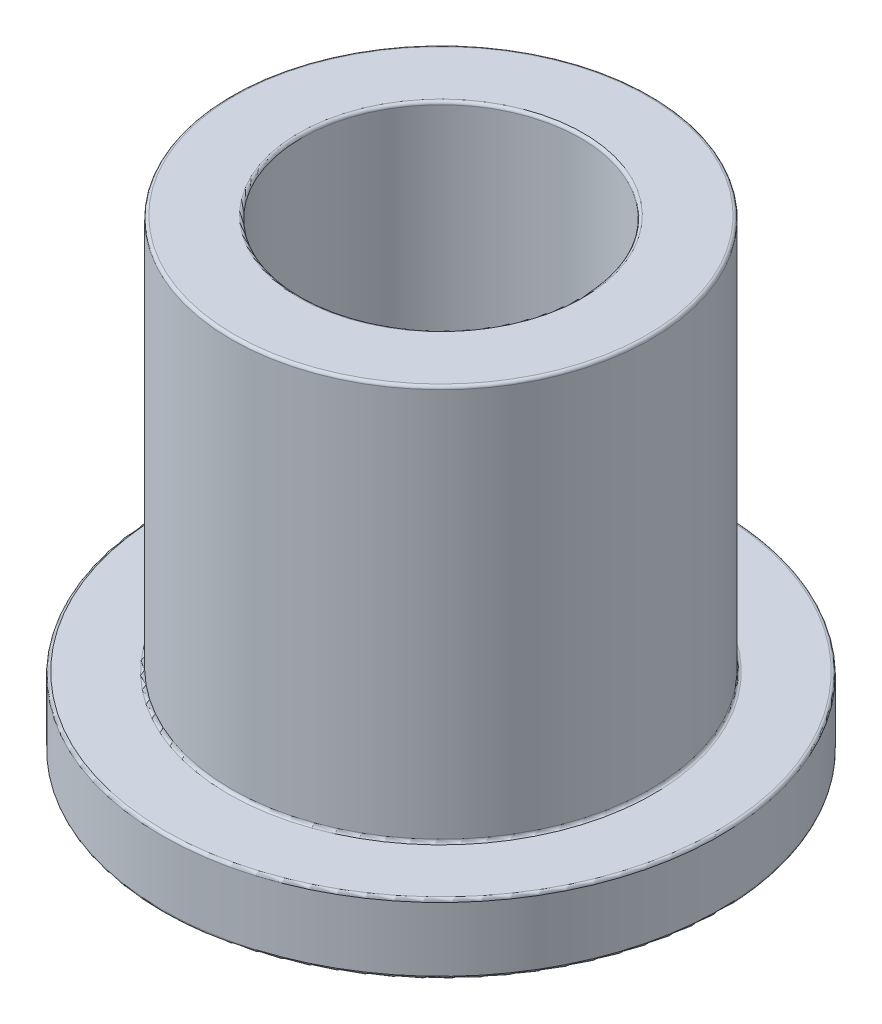
ISO-10303-21;
HEADER;
FILE_DESCRIPTION(('STEP AP214'),'2;1');
FILE_NAME('part.step','',(''),(''),'','','');
FILE_SCHEMA(('AUTOMOTIVE_DESIGN { 1 0 10303 214 1 1 1 1 }'));
ENDSEC;
DATA;
#1=APPLICATION_CONTEXT('core data for automotive mechanical design processes');
#2=APPLICATION_PROTOCOL_DEFINITION('international standard','automotive_design',2000,#1);
#3=PRODUCT_CONTEXT('',#1,'mechanical');
#4=PRODUCT('Part','Part','',(#3));
#5=PRODUCT_RELATED_PRODUCT_CATEGORY('part','',(#4));
#6=PRODUCT_DEFINITION_FORMATION('','',#4);
#7=PRODUCT_DEFINITION_CONTEXT('part definition',#1,'design');
#8=PRODUCT_DEFINITION('design','',#6,#7);
#9=PRODUCT_DEFINITION_SHAPE('','',#8);
#10=(LENGTH_UNIT() NAMED_UNIT(*) SI_UNIT(.MILLI.,.METRE.));
#11=(NAMED_UNIT(*) PLANE_ANGLE_UNIT() SI_UNIT($,.RADIAN.));
#12=(NAMED_UNIT(*) SI_UNIT($,.STERADIAN.) SOLID_ANGLE_UNIT());
#13=UNCERTAINTY_MEASURE_WITH_UNIT(LENGTH_MEASURE(1.E-05),#10,'distance_accuracy_value','');
#14=(GEOMETRIC_REPRESENTATION_CONTEXT(3) GLOBAL_UNCERTAINTY_ASSIGNED_CONTEXT((#13)) GLOBAL_UNIT_ASSIGNED_CONTEXT((#10,
#11,#12)) REPRESENTATION_CONTEXT('',''));
#15=CARTESIAN_POINT('',(0.,0.,0.));
#16=DIRECTION('',(0.,0.,1.));
#17=DIRECTION('',(1.,0.,0.));
#18=AXIS2_PLACEMENT_3D('',#15,#16,#17);
#19=CARTESIAN_POINT('',(0.,20.,0.));
#20=DIRECTION('',(0.,1.,0.));
#21=DIRECTION('',(0.,0.,1.));
#22=AXIS2_PLACEMENT_3D('',#19,#20,#21);
#23=PLANE('',#22);
#24=CARTESIAN_POINT('',(0.,20.,0.));
#25=DIRECTION('',(0.,1.,0.));
#26=DIRECTION('',(0.,0.,1.));
#27=AXIS2_PLACEMENT_3D('',#24,#25,#26);
#28=CIRCLE('',#27,6.13);
#29=CARTESIAN_POINT('',(0.,20.,6.13));
#30=VERTEX_POINT('',#29);
#31=EDGE_CURVE('E10',#30,#30,#28,.F.);
#32=ORIENTED_EDGE('',*,*,#31,.T.);
#33=EDGE_LOOP('',(#32));
#34=FACE_BOUND('',#33,.T.);
#35=CARTESIAN_POINT('',(0.,20.,0.));
#36=DIRECTION('',(0.,1.,0.));
#37=DIRECTION('',(0.,0.,1.));
#38=AXIS2_PLACEMENT_3D('',#35,#36,#37);
#39=CIRCLE('',#38,8.89);
#40=CARTESIAN_POINT('',(0.,20.,8.89));
#41=VERTEX_POINT('',#40);
#42=EDGE_CURVE('E37',#41,#41,#39,.T.);
#43=ORIENTED_EDGE('',*,*,#42,.T.);
#44=EDGE_LOOP('',(#43));
#45=FACE_BOUND('',#44,.T.);
#46=ADVANCED_FACE('F30',(#34,#45),#23,.T.);
#47=CARTESIAN_POINT('',(0.,0.,0.));
#48=DIRECTION('',(0.,1.,0.));
#49=DIRECTION('',(0.,0.,1.));
#50=AXIS2_PLACEMENT_3D('',#47,#48,#49);
#51=PLANE('',#50);
#52=CARTESIAN_POINT('',(0.,0.,0.));
#53=DIRECTION('',(0.,1.,0.));
#54=DIRECTION('',(0.,0.,1.));
#55=AXIS2_PLACEMENT_3D('',#52,#53,#54);
#56=CIRCLE('',#55,6.13);
#57=CARTESIAN_POINT('',(0.,0.,6.13));
#58=VERTEX_POINT('',#57);
#59=EDGE_CURVE('E68',#58,#58,#56,.T.);
#60=ORIENTED_EDGE('',*,*,#59,.T.);
#61=EDGE_LOOP('',(#60));
#62=FACE_BOUND('',#61,.T.);
#63=CARTESIAN_POINT('',(0.,0.,0.));
#64=DIRECTION('',(0.,1.,0.));
#65=DIRECTION('',(0.,0.,1.));
#66=AXIS2_PLACEMENT_3D('',#63,#64,#65);
#67=CIRCLE('',#66,11.875);
#68=CARTESIAN_POINT('',(0.,0.,11.875));
#69=VERTEX_POINT('',#68);
#70=EDGE_CURVE('E71',#69,#69,#67,.F.);
#71=ORIENTED_EDGE('',*,*,#70,.T.);
#72=EDGE_LOOP('',(#71));
#73=FACE_BOUND('',#72,.T.);
#74=ADVANCED_FACE('F75',(#62,#73),#51,.F.);
#75=CARTESIAN_POINT('',(0.,20.,0.));
#76=DIRECTION('',(0.,-1.,0.));
#77=DIRECTION('',(0.,0.,-1.));
#78=AXIS2_PLACEMENT_3D('',#75,#76,#77);
#79=CYLINDRICAL_SURFACE('',#78,9.015);
#80=CARTESIAN_POINT('',(0.,3.125,0.));
#81=DIRECTION('',(0.,1.,0.));
#82=DIRECTION('',(0.,0.,1.));
#83=AXIS2_PLACEMENT_3D('',#80,#81,#82);
#84=CIRCLE('',#83,9.015);
#85=CARTESIAN_POINT('',(0.,3.125,9.015));
#86=VERTEX_POINT('',#85);
#87=EDGE_CURVE('E50',#86,#86,#84,.T.);
#88=ORIENTED_EDGE('',*,*,#87,.T.);
#89=EDGE_LOOP('',(#88));
#90=FACE_BOUND('',#89,.T.);
#91=CARTESIAN_POINT('',(0.,19.875,0.));
#92=DIRECTION('',(0.,1.,0.));
#93=DIRECTION('',(0.,0.,1.));
#94=AXIS2_PLACEMENT_3D('',#91,#92,#93);
#95=CIRCLE('',#94,9.015);
#96=CARTESIAN_POINT('',(0.,19.875,9.015));
#97=VERTEX_POINT('',#96);
#98=EDGE_CURVE('E53',#97,#97,#95,.F.);
#99=ORIENTED_EDGE('',*,*,#98,.T.);
#100=EDGE_LOOP('',(#99));
#101=FACE_BOUND('',#100,.T.);
#102=ADVANCED_FACE('F106',(#90,#101),#79,.T.);
#103=CARTESIAN_POINT('',(0.,20.,0.));
#104=DIRECTION('',(0.,-1.,0.));
#105=DIRECTION('',(0.,0.,-1.));
#106=AXIS2_PLACEMENT_3D('',#103,#104,#105);
#107=CYLINDRICAL_SURFACE('',#106,6.005);
#108=CARTESIAN_POINT('',(0.,0.125,0.));
#109=DIRECTION('',(0.,1.,0.));
#110=DIRECTION('',(0.,0.,1.));
#111=AXIS2_PLACEMENT_3D('',#108,#109,#110);
#112=CIRCLE('',#111,6.005);
#113=CARTESIAN_POINT('',(0.,0.125,6.005));
#114=VERTEX_POINT('',#113);
#115=EDGE_CURVE('E62',#114,#114,#112,.F.);
#116=ORIENTED_EDGE('',*,*,#115,.T.);
#117=EDGE_LOOP('',(#116));
#118=FACE_BOUND('',#117,.T.);
#119=CARTESIAN_POINT('',(0.,19.875,0.));
#120=DIRECTION('',(0.,1.,0.));
#121=DIRECTION('',(0.,0.,1.));
#122=AXIS2_PLACEMENT_3D('',#119,#120,#121);
#123=CIRCLE('',#122,6.005);
#124=CARTESIAN_POINT('',(0.,19.875,6.005));
#125=VERTEX_POINT('',#124);
#126=EDGE_CURVE('E65',#125,#125,#123,.T.);
#127=ORIENTED_EDGE('',*,*,#126,.T.);
#128=EDGE_LOOP('',(#127));
#129=FACE_BOUND('',#128,.T.);
#130=ADVANCED_FACE('F100',(#118,#129),#107,.F.);
#131=CARTESIAN_POINT('',(0.,3.,0.));
#132=DIRECTION('',(0.,1.,0.));
#133=DIRECTION('',(0.,0.,1.));
#134=AXIS2_PLACEMENT_3D('',#131,#132,#133);
#135=PLANE('',#134);
#136=CARTESIAN_POINT('',(0.,3.,0.));
#137=DIRECTION('',(0.,1.,0.));
#138=DIRECTION('',(0.,0.,1.));
#139=AXIS2_PLACEMENT_3D('',#136,#137,#138);
#140=CIRCLE('',#139,9.14);
#141=CARTESIAN_POINT('',(0.,3.,9.14));
#142=VERTEX_POINT('',#141);
#143=EDGE_CURVE('E41',#142,#142,#140,.F.);
#144=ORIENTED_EDGE('',*,*,#143,.T.);
#145=EDGE_LOOP('',(#144));
#146=FACE_BOUND('',#145,.T.);
#147=CARTESIAN_POINT('',(0.,3.,0.));
#148=DIRECTION('',(0.,1.,0.));
#149=DIRECTION('',(0.,0.,1.));
#150=AXIS2_PLACEMENT_3D('',#147,#148,#149);
#151=CIRCLE('',#150,11.875);
#152=CARTESIAN_POINT('',(0.,3.,11.875));
#153=VERTEX_POINT('',#152);
#154=EDGE_CURVE('E45',#153,#153,#151,.T.);
#155=ORIENTED_EDGE('',*,*,#154,.T.);
#156=EDGE_LOOP('',(#155));
#157=FACE_BOUND('',#156,.T.);
#158=ADVANCED_FACE('F88',(#146,#157),#135,.T.);
#159=CARTESIAN_POINT('',(0.,3.,0.));
#160=DIRECTION('',(0.,-1.,0.));
#161=DIRECTION('',(0.,0.,-1.));
#162=AXIS2_PLACEMENT_3D('',#159,#160,#161);
#163=CYLINDRICAL_SURFACE('',#162,12.);
#164=CARTESIAN_POINT('',(0.,0.125,0.));
#165=DIRECTION('',(0.,1.,0.));
#166=DIRECTION('',(0.,0.,1.));
#167=AXIS2_PLACEMENT_3D('',#164,#165,#166);
#168=CIRCLE('',#167,12.);
#169=CARTESIAN_POINT('',(0.,0.125,12.));
#170=VERTEX_POINT('',#169);
#171=EDGE_CURVE('E56',#170,#170,#168,.T.);
#172=ORIENTED_EDGE('',*,*,#171,.T.);
#173=EDGE_LOOP('',(#172));
#174=FACE_BOUND('',#173,.T.);
#175=CARTESIAN_POINT('',(0.,2.875,0.));
#176=DIRECTION('',(0.,1.,0.));
#177=DIRECTION('',(0.,0.,1.));
#178=AXIS2_PLACEMENT_3D('',#175,#176,#177);
#179=CIRCLE('',#178,12.);
#180=CARTESIAN_POINT('',(0.,2.875,12.));
#181=VERTEX_POINT('',#180);
#182=EDGE_CURVE('E59',#181,#181,#179,.F.);
#183=ORIENTED_EDGE('',*,*,#182,.T.);
#184=EDGE_LOOP('',(#183));
#185=FACE_BOUND('',#184,.T.);
#186=ADVANCED_FACE('F85',(#174,#185),#163,.T.);
#187=CARTESIAN_POINT('',(0.,0.125,0.));
#188=DIRECTION('',(0.,1.,0.));
#189=DIRECTION('',(0.,0.,1.));
#190=AXIS2_PLACEMENT_3D('',#187,#188,#189);
#191=TOROIDAL_SURFACE('',#190,6.13,0.125);
#192=ORIENTED_EDGE('',*,*,#115,.F.);
#193=EDGE_LOOP('',(#192));
#194=FACE_BOUND('',#193,.T.);
#195=ORIENTED_EDGE('',*,*,#59,.F.);
#196=EDGE_LOOP('',(#195));
#197=FACE_BOUND('',#196,.T.);
#198=ADVANCED_FACE('F81',(#194,#197),#191,.T.);
#199=CARTESIAN_POINT('',(0.,0.125,0.));
#200=DIRECTION('',(0.,1.,0.));
#201=DIRECTION('',(0.,0.,1.));
#202=AXIS2_PLACEMENT_3D('',#199,#200,#201);
#203=TOROIDAL_SURFACE('',#202,11.875,0.125);
#204=ORIENTED_EDGE('',*,*,#70,.F.);
#205=EDGE_LOOP('',(#204));
#206=FACE_BOUND('',#205,.T.);
#207=ORIENTED_EDGE('',*,*,#171,.F.);
#208=EDGE_LOOP('',(#207));
#209=FACE_BOUND('',#208,.T.);
#210=ADVANCED_FACE('F77',(#206,#209),#203,.T.);
#211=CARTESIAN_POINT('',(0.,3.125,0.));
#212=DIRECTION('',(0.,1.,0.));
#213=DIRECTION('',(0.,0.,1.));
#214=AXIS2_PLACEMENT_3D('',#211,#212,#213);
#215=TOROIDAL_SURFACE('',#214,9.14,0.125);
#216=ORIENTED_EDGE('',*,*,#143,.F.);
#217=EDGE_LOOP('',(#216));
#218=FACE_BOUND('',#217,.T.);
#219=ORIENTED_EDGE('',*,*,#87,.F.);
#220=EDGE_LOOP('',(#219));
#221=FACE_BOUND('',#220,.T.);
#222=ADVANCED_FACE('F80',(#218,#221),#215,.F.);
#223=CARTESIAN_POINT('',(0.,2.875,0.));
#224=DIRECTION('',(0.,1.,0.));
#225=DIRECTION('',(0.,0.,1.));
#226=AXIS2_PLACEMENT_3D('',#223,#224,#225);
#227=TOROIDAL_SURFACE('',#226,11.875,0.125);
#228=ORIENTED_EDGE('',*,*,#182,.F.);
#229=EDGE_LOOP('',(#228));
#230=FACE_BOUND('',#229,.T.);
#231=ORIENTED_EDGE('',*,*,#154,.F.);
#232=EDGE_LOOP('',(#231));
#233=FACE_BOUND('',#232,.T.);
#234=ADVANCED_FACE('F92',(#230,#233),#227,.T.);
#235=CARTESIAN_POINT('',(0.,19.875,0.));
#236=DIRECTION('',(0.,1.,0.));
#237=DIRECTION('',(0.,0.,1.));
#238=AXIS2_PLACEMENT_3D('',#235,#236,#237);
#239=TOROIDAL_SURFACE('',#238,6.13,0.125);
#240=ORIENTED_EDGE('',*,*,#31,.F.);
#241=EDGE_LOOP('',(#240));
#242=FACE_BOUND('',#241,.T.);
#243=ORIENTED_EDGE('',*,*,#126,.F.);
#244=EDGE_LOOP('',(#243));
#245=FACE_BOUND('',#244,.T.);
#246=ADVANCED_FACE('F95',(#242,#245),#239,.T.);
#247=CARTESIAN_POINT('',(0.,19.875,0.));
#248=DIRECTION('',(0.,1.,0.));
#249=DIRECTION('',(0.,0.,1.));
#250=AXIS2_PLACEMENT_3D('',#247,#248,#249);
#251=TOROIDAL_SURFACE('',#250,8.89,0.125);
#252=ORIENTED_EDGE('',*,*,#98,.F.);
#253=EDGE_LOOP('',(#252));
#254=FACE_BOUND('',#253,.T.);
#255=ORIENTED_EDGE('',*,*,#42,.F.);
#256=EDGE_LOOP('',(#255));
#257=FACE_BOUND('',#256,.T.);
#258=ADVANCED_FACE('F32',(#254,#257),#251,.T.);
#259=CLOSED_SHELL('',(#46,#74,#102,#130,#158,#186,#198,#210,#222,#234,#246,#258));
#260=MANIFOLD_SOLID_BREP('B2',#259);
#261=ADVANCED_BREP_SHAPE_REPRESENTATION('',(#18,#260),#14);
#262=SHAPE_DEFINITION_REPRESENTATION(#9,#261);
ENDSEC;
END-ISO-10303-21;
